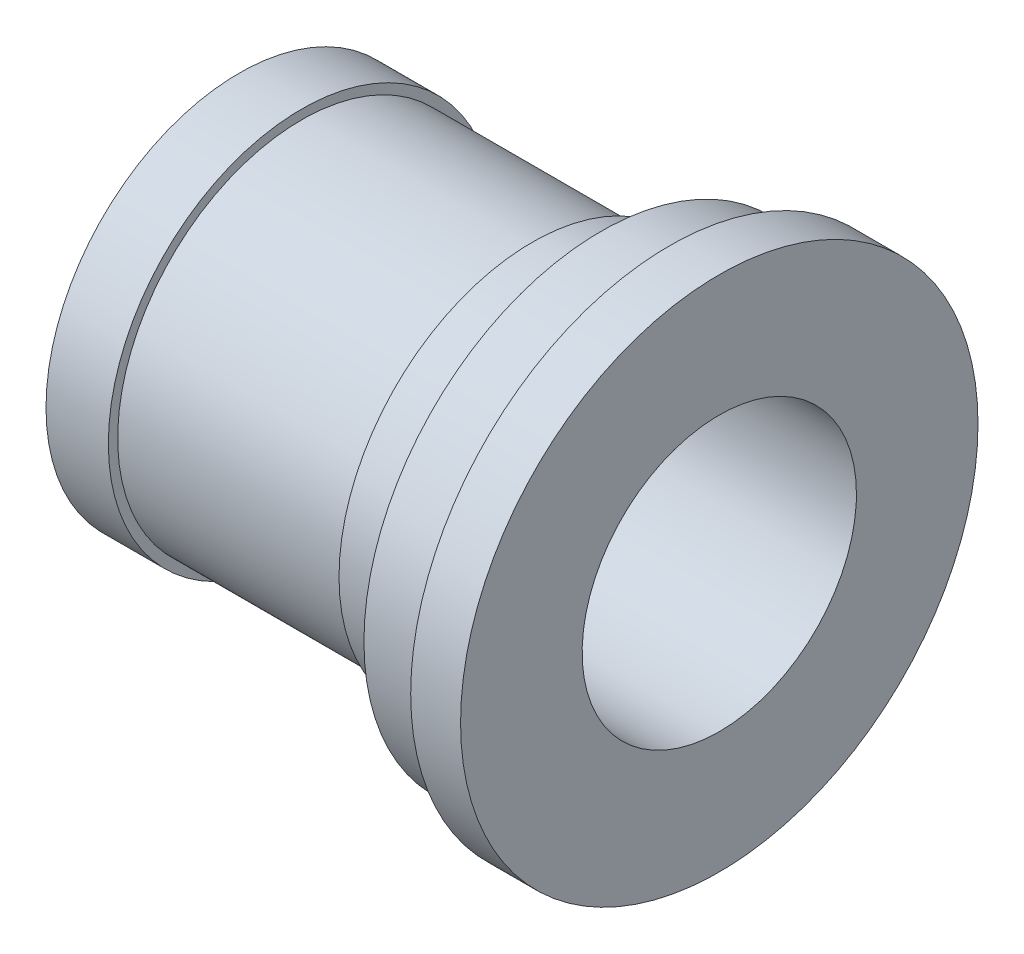
ISO-10303-21;
HEADER;
FILE_DESCRIPTION(('STEP AP214'),'2;1');
FILE_NAME('part.step','',(''),(''),'','','');
FILE_SCHEMA(('AUTOMOTIVE_DESIGN { 1 0 10303 214 1 1 1 1 }'));
ENDSEC;
DATA;
#1=APPLICATION_CONTEXT('core data for automotive mechanical design processes');
#2=APPLICATION_PROTOCOL_DEFINITION('international standard','automotive_design',2000,#1);
#3=PRODUCT_CONTEXT('',#1,'mechanical');
#4=PRODUCT('Part','Part','',(#3));
#5=PRODUCT_RELATED_PRODUCT_CATEGORY('part','',(#4));
#6=PRODUCT_DEFINITION_FORMATION('','',#4);
#7=PRODUCT_DEFINITION_CONTEXT('part definition',#1,'design');
#8=PRODUCT_DEFINITION('design','',#6,#7);
#9=PRODUCT_DEFINITION_SHAPE('','',#8);
#10=(LENGTH_UNIT() NAMED_UNIT(*) SI_UNIT(.MILLI.,.METRE.));
#11=(NAMED_UNIT(*) PLANE_ANGLE_UNIT() SI_UNIT($,.RADIAN.));
#12=(NAMED_UNIT(*) SI_UNIT($,.STERADIAN.) SOLID_ANGLE_UNIT());
#13=UNCERTAINTY_MEASURE_WITH_UNIT(LENGTH_MEASURE(1.E-05),#10,'distance_accuracy_value','');
#14=(GEOMETRIC_REPRESENTATION_CONTEXT(3) GLOBAL_UNCERTAINTY_ASSIGNED_CONTEXT((#13)) GLOBAL_UNIT_ASSIGNED_CONTEXT((#10,
#11,#12)) REPRESENTATION_CONTEXT('',''));
#15=CARTESIAN_POINT('',(0.,0.,0.));
#16=DIRECTION('',(0.,0.,1.));
#17=DIRECTION('',(1.,0.,0.));
#18=AXIS2_PLACEMENT_3D('',#15,#16,#17);
#19=CARTESIAN_POINT('',(10.,0.,0.));
#20=DIRECTION('',(1.,0.,0.));
#21=DIRECTION('',(0.,0.,-1.));
#22=AXIS2_PLACEMENT_3D('',#19,#20,#21);
#23=PLANE('',#22);
#24=CARTESIAN_POINT('',(10.,0.,0.));
#25=DIRECTION('',(1.,0.,0.));
#26=DIRECTION('',(0.,0.,-1.));
#27=AXIS2_PLACEMENT_3D('',#24,#25,#26);
#28=CIRCLE('',#27,31.);
#29=CARTESIAN_POINT('',(10.,0.,-31.));
#30=VERTEX_POINT('',#29);
#31=EDGE_CURVE('E75',#30,#30,#28,.T.);
#32=ORIENTED_EDGE('',*,*,#31,.T.);
#33=EDGE_LOOP('',(#32));
#34=FACE_BOUND('',#33,.T.);
#35=CARTESIAN_POINT('',(10.,0.,0.));
#36=DIRECTION('',(1.,0.,0.));
#37=DIRECTION('',(0.,0.,-1.));
#38=AXIS2_PLACEMENT_3D('',#35,#36,#37);
#39=CIRCLE('',#38,29.5);
#40=CARTESIAN_POINT('',(10.,0.,-29.5));
#41=VERTEX_POINT('',#40);
#42=EDGE_CURVE('E78',#41,#41,#39,.T.);
#43=ORIENTED_EDGE('',*,*,#42,.F.);
#44=EDGE_LOOP('',(#43));
#45=FACE_BOUND('',#44,.T.);
#46=ADVANCED_FACE('F33',(#34,#45),#23,.T.);
#47=CARTESIAN_POINT('',(0.,0.,0.));
#48=DIRECTION('',(1.,0.,0.));
#49=DIRECTION('',(0.,0.,-1.));
#50=AXIS2_PLACEMENT_3D('',#47,#48,#49);
#51=PLANE('',#50);
#52=CARTESIAN_POINT('',(0.,0.,0.));
#53=DIRECTION('',(1.,0.,0.));
#54=DIRECTION('',(0.,0.,-1.));
#55=AXIS2_PLACEMENT_3D('',#52,#53,#54);
#56=CIRCLE('',#55,31.);
#57=CARTESIAN_POINT('',(0.,0.,-31.));
#58=VERTEX_POINT('',#57);
#59=EDGE_CURVE('E71',#58,#58,#56,.T.);
#60=ORIENTED_EDGE('',*,*,#59,.F.);
#61=EDGE_LOOP('',(#60));
#62=FACE_BOUND('',#61,.T.);
#63=CARTESIAN_POINT('',(0.,0.,0.));
#64=DIRECTION('',(1.,0.,0.));
#65=DIRECTION('',(0.,0.,-1.));
#66=AXIS2_PLACEMENT_3D('',#63,#64,#65);
#67=CIRCLE('',#66,22.);
#68=CARTESIAN_POINT('',(0.,1.49912810403716,-21.9488636363636));
#69=VERTEX_POINT('',#68);
#70=CARTESIAN_POINT('',(0.,-1.49912810403716,-21.9488636363636));
#71=VERTEX_POINT('',#70);
#72=EDGE_CURVE('E67',#69,#71,#67,.T.);
#73=ORIENTED_EDGE('',*,*,#72,.T.);
#74=CARTESIAN_POINT('',(0.,0.,-22.));
#75=DIRECTION('',(-1.,0.,0.));
#76=DIRECTION('',(0.,0.,1.));
#77=AXIS2_PLACEMENT_3D('',#74,#75,#76);
#78=CIRCLE('',#77,1.5);
#79=EDGE_CURVE('E60',#69,#71,#78,.T.);
#80=ORIENTED_EDGE('',*,*,#79,.F.);
#81=EDGE_LOOP('',(#73,#80));
#82=FACE_BOUND('',#81,.T.);
#83=ADVANCED_FACE('F66',(#62,#82),#51,.F.);
#84=CARTESIAN_POINT('',(10.,0.,0.));
#85=DIRECTION('',(-1.,0.,0.));
#86=DIRECTION('',(0.,0.,1.));
#87=AXIS2_PLACEMENT_3D('',#84,#85,#86);
#88=CYLINDRICAL_SURFACE('',#87,31.);
#89=ORIENTED_EDGE('',*,*,#31,.F.);
#90=EDGE_LOOP('',(#89));
#91=FACE_BOUND('',#90,.T.);
#92=ORIENTED_EDGE('',*,*,#59,.T.);
#93=EDGE_LOOP('',(#92));
#94=FACE_BOUND('',#93,.T.);
#95=ADVANCED_FACE('F35',(#91,#94),#88,.T.);
#96=CARTESIAN_POINT('',(10.,0.,0.));
#97=DIRECTION('',(-1.,0.,0.));
#98=DIRECTION('',(0.,0.,1.));
#99=AXIS2_PLACEMENT_3D('',#96,#97,#98);
#100=CYLINDRICAL_SURFACE('',#99,22.);
#101=DIRECTION('',(-1.,0.,0.));
#102=VECTOR('',#101,1.);
#103=CARTESIAN_POINT('',(2.5,-1.49912810403716,-21.9488636363636));
#104=LINE('',#103,#102);
#105=CARTESIAN_POINT('',(5.,-1.49912810403716,-21.9488636363636));
#106=VERTEX_POINT('',#105);
#107=EDGE_CURVE('E11',#71,#106,#104,.F.);
#108=ORIENTED_EDGE('',*,*,#107,.F.);
#109=ORIENTED_EDGE('',*,*,#72,.F.);
#110=DIRECTION('',(-1.,0.,0.));
#111=VECTOR('',#110,1.);
#112=CARTESIAN_POINT('',(2.5,1.49912810403716,-21.9488636363636));
#113=LINE('',#112,#111);
#114=CARTESIAN_POINT('',(5.,1.49912810403716,-21.9488636363636));
#115=VERTEX_POINT('',#114);
#116=EDGE_CURVE('E41',#115,#69,#113,.T.);
#117=ORIENTED_EDGE('',*,*,#116,.F.);
#118=CARTESIAN_POINT('',(5.,0.,0.));
#119=DIRECTION('',(-1.,0.,0.));
#120=DIRECTION('',(0.,0.,1.));
#121=AXIS2_PLACEMENT_3D('',#118,#119,#120);
#122=CIRCLE('',#121,22.);
#123=EDGE_CURVE('E50',#115,#106,#122,.T.);
#124=ORIENTED_EDGE('',*,*,#123,.T.);
#125=EDGE_LOOP('',(#108,#109,#117,#124));
#126=FACE_BOUND('',#125,.T.);
#127=CARTESIAN_POINT('',(77.,0.,0.));
#128=DIRECTION('',(1.,0.,0.));
#129=DIRECTION('',(0.,0.,-1.));
#130=AXIS2_PLACEMENT_3D('',#127,#128,#129);
#131=CIRCLE('',#130,22.);
#132=CARTESIAN_POINT('',(77.,0.,-22.));
#133=VERTEX_POINT('',#132);
#134=EDGE_CURVE('E236',#133,#133,#131,.T.);
#135=ORIENTED_EDGE('',*,*,#134,.T.);
#136=EDGE_LOOP('',(#135));
#137=FACE_BOUND('',#136,.T.);
#138=ADVANCED_FACE('F69',(#126,#137),#100,.F.);
#139=CARTESIAN_POINT('',(47.,0.,0.));
#140=DIRECTION('',(-1.,0.,0.));
#141=DIRECTION('',(0.,0.,1.));
#142=AXIS2_PLACEMENT_3D('',#139,#140,#141);
#143=CYLINDRICAL_SURFACE('',#142,29.5);
#144=CARTESIAN_POINT('',(47.,0.,0.));
#145=DIRECTION('',(1.,0.,0.));
#146=DIRECTION('',(0.,0.,-1.));
#147=AXIS2_PLACEMENT_3D('',#144,#145,#146);
#148=CIRCLE('',#147,29.5);
#149=CARTESIAN_POINT('',(47.,0.,-29.5));
#150=VERTEX_POINT('',#149);
#151=EDGE_CURVE('E72',#150,#150,#148,.T.);
#152=ORIENTED_EDGE('',*,*,#151,.F.);
#153=EDGE_LOOP('',(#152));
#154=FACE_BOUND('',#153,.T.);
#155=ORIENTED_EDGE('',*,*,#42,.T.);
#156=EDGE_LOOP('',(#155));
#157=FACE_BOUND('',#156,.T.);
#158=ADVANCED_FACE('F100',(#154,#157),#143,.T.);
#159=CARTESIAN_POINT('',(47.,0.,0.));
#160=DIRECTION('',(1.,0.,0.));
#161=DIRECTION('',(0.,0.,-1.));
#162=AXIS2_PLACEMENT_3D('',#159,#160,#161);
#163=PLANE('',#162);
#164=ORIENTED_EDGE('',*,*,#151,.T.);
#165=EDGE_LOOP('',(#164));
#166=FACE_BOUND('',#165,.T.);
#167=CARTESIAN_POINT('',(47.,0.,0.));
#168=DIRECTION('',(1.,0.,0.));
#169=DIRECTION('',(0.,0.,-1.));
#170=AXIS2_PLACEMENT_3D('',#167,#168,#169);
#171=CIRCLE('',#170,31.);
#172=CARTESIAN_POINT('',(47.,0.,-31.));
#173=VERTEX_POINT('',#172);
#174=EDGE_CURVE('E248',#173,#173,#171,.T.);
#175=ORIENTED_EDGE('',*,*,#174,.F.);
#176=EDGE_LOOP('',(#175));
#177=FACE_BOUND('',#176,.T.);
#178=ADVANCED_FACE('F103',(#166,#177),#163,.F.);
#179=CARTESIAN_POINT('',(58.,0.,0.));
#180=DIRECTION('',(-1.,0.,0.));
#181=DIRECTION('',(0.,0.,1.));
#182=AXIS2_PLACEMENT_3D('',#179,#180,#181);
#183=CYLINDRICAL_SURFACE('',#182,31.);
#184=CARTESIAN_POINT('',(58.,0.,0.));
#185=DIRECTION('',(1.,0.,0.));
#186=DIRECTION('',(0.,0.,-1.));
#187=AXIS2_PLACEMENT_3D('',#184,#185,#186);
#188=CIRCLE('',#187,31.);
#189=CARTESIAN_POINT('',(58.,0.,-31.));
#190=VERTEX_POINT('',#189);
#191=EDGE_CURVE('E251',#190,#190,#188,.T.);
#192=ORIENTED_EDGE('',*,*,#191,.F.);
#193=EDGE_LOOP('',(#192));
#194=FACE_BOUND('',#193,.T.);
#195=ORIENTED_EDGE('',*,*,#174,.T.);
#196=EDGE_LOOP('',(#195));
#197=FACE_BOUND('',#196,.T.);
#198=ADVANCED_FACE('F105',(#194,#197),#183,.T.);
#199=CARTESIAN_POINT('',(58.,0.,0.));
#200=DIRECTION('',(1.,0.,0.));
#201=DIRECTION('',(0.,0.,-1.));
#202=AXIS2_PLACEMENT_3D('',#199,#200,#201);
#203=PLANE('',#202);
#204=ORIENTED_EDGE('',*,*,#191,.T.);
#205=EDGE_LOOP('',(#204));
#206=FACE_BOUND('',#205,.T.);
#207=CARTESIAN_POINT('',(58.,0.,0.));
#208=DIRECTION('',(1.,0.,0.));
#209=DIRECTION('',(0.,0.,-1.));
#210=AXIS2_PLACEMENT_3D('',#207,#208,#209);
#211=CIRCLE('',#210,38.);
#212=CARTESIAN_POINT('',(58.,0.,-38.));
#213=VERTEX_POINT('',#212);
#214=EDGE_CURVE('E243',#213,#213,#211,.T.);
#215=ORIENTED_EDGE('',*,*,#214,.F.);
#216=EDGE_LOOP('',(#215));
#217=FACE_BOUND('',#216,.T.);
#218=ADVANCED_FACE('F108',(#206,#217),#203,.F.);
#219=CARTESIAN_POINT('',(69.,0.,0.));
#220=DIRECTION('',(-1.,0.,0.));
#221=DIRECTION('',(0.,0.,1.));
#222=AXIS2_PLACEMENT_3D('',#219,#220,#221);
#223=CYLINDRICAL_SURFACE('',#222,38.);
#224=CARTESIAN_POINT('',(69.,0.,0.));
#225=DIRECTION('',(1.,0.,0.));
#226=DIRECTION('',(0.,0.,-1.));
#227=AXIS2_PLACEMENT_3D('',#224,#225,#226);
#228=CIRCLE('',#227,38.);
#229=CARTESIAN_POINT('',(69.,0.,-38.));
#230=VERTEX_POINT('',#229);
#231=EDGE_CURVE('E245',#230,#230,#228,.T.);
#232=ORIENTED_EDGE('',*,*,#231,.F.);
#233=EDGE_LOOP('',(#232));
#234=FACE_BOUND('',#233,.T.);
#235=ORIENTED_EDGE('',*,*,#214,.T.);
#236=EDGE_LOOP('',(#235));
#237=FACE_BOUND('',#236,.T.);
#238=ADVANCED_FACE('F113',(#234,#237),#223,.T.);
#239=CARTESIAN_POINT('',(77.,0.,0.));
#240=DIRECTION('',(1.,0.,0.));
#241=DIRECTION('',(0.,0.,-1.));
#242=AXIS2_PLACEMENT_3D('',#239,#240,#241);
#243=PLANE('',#242);
#244=CARTESIAN_POINT('',(77.,0.,0.));
#245=DIRECTION('',(1.,0.,0.));
#246=DIRECTION('',(0.,0.,-1.));
#247=AXIS2_PLACEMENT_3D('',#244,#245,#246);
#248=CIRCLE('',#247,41.5);
#249=CARTESIAN_POINT('',(77.,0.,-41.5));
#250=VERTEX_POINT('',#249);
#251=EDGE_CURVE('E233',#250,#250,#248,.T.);
#252=ORIENTED_EDGE('',*,*,#251,.T.);
#253=EDGE_LOOP('',(#252));
#254=FACE_BOUND('',#253,.T.);
#255=ORIENTED_EDGE('',*,*,#134,.F.);
#256=EDGE_LOOP('',(#255));
#257=FACE_BOUND('',#256,.T.);
#258=ADVANCED_FACE('F116',(#254,#257),#243,.T.);
#259=CARTESIAN_POINT('',(69.,0.,0.));
#260=DIRECTION('',(1.,0.,0.));
#261=DIRECTION('',(0.,0.,-1.));
#262=AXIS2_PLACEMENT_3D('',#259,#260,#261);
#263=PLANE('',#262);
#264=ORIENTED_EDGE('',*,*,#231,.T.);
#265=EDGE_LOOP('',(#264));
#266=FACE_BOUND('',#265,.T.);
#267=CARTESIAN_POINT('',(69.,0.,0.));
#268=DIRECTION('',(1.,0.,0.));
#269=DIRECTION('',(0.,0.,-1.));
#270=AXIS2_PLACEMENT_3D('',#267,#268,#269);
#271=CIRCLE('',#270,41.5);
#272=CARTESIAN_POINT('',(69.,0.,-41.5));
#273=VERTEX_POINT('',#272);
#274=EDGE_CURVE('E237',#273,#273,#271,.T.);
#275=ORIENTED_EDGE('',*,*,#274,.F.);
#276=EDGE_LOOP('',(#275));
#277=FACE_BOUND('',#276,.T.);
#278=ADVANCED_FACE('F124',(#266,#277),#263,.F.);
#279=CARTESIAN_POINT('',(77.,0.,0.));
#280=DIRECTION('',(-1.,0.,0.));
#281=DIRECTION('',(0.,0.,1.));
#282=AXIS2_PLACEMENT_3D('',#279,#280,#281);
#283=CYLINDRICAL_SURFACE('',#282,41.5);
#284=ORIENTED_EDGE('',*,*,#251,.F.);
#285=EDGE_LOOP('',(#284));
#286=FACE_BOUND('',#285,.T.);
#287=ORIENTED_EDGE('',*,*,#274,.T.);
#288=EDGE_LOOP('',(#287));
#289=FACE_BOUND('',#288,.T.);
#290=ADVANCED_FACE('F121',(#286,#289),#283,.T.);
#291=CARTESIAN_POINT('',(5.,0.,-22.));
#292=DIRECTION('',(-1.,0.,0.));
#293=DIRECTION('',(0.,0.,1.));
#294=AXIS2_PLACEMENT_3D('',#291,#292,#293);
#295=CYLINDRICAL_SURFACE('',#294,1.5);
#296=ORIENTED_EDGE('',*,*,#107,.T.);
#297=CARTESIAN_POINT('',(5.,0.,-22.));
#298=DIRECTION('',(-1.,0.,0.));
#299=DIRECTION('',(0.,0.,1.));
#300=AXIS2_PLACEMENT_3D('',#297,#298,#299);
#301=CIRCLE('',#300,1.5);
#302=EDGE_CURVE('E47',#115,#106,#301,.T.);
#303=ORIENTED_EDGE('',*,*,#302,.F.);
#304=ORIENTED_EDGE('',*,*,#116,.T.);
#305=ORIENTED_EDGE('',*,*,#79,.T.);
#306=EDGE_LOOP('',(#296,#303,#304,#305));
#307=FACE_BOUND('',#306,.T.);
#308=ADVANCED_FACE('F59',(#307),#295,.F.);
#309=CARTESIAN_POINT('',(5.,0.,-22.));
#310=DIRECTION('',(-1.,0.,0.));
#311=DIRECTION('',(0.,0.,1.));
#312=AXIS2_PLACEMENT_3D('',#309,#310,#311);
#313=PLANE('',#312);
#314=ORIENTED_EDGE('',*,*,#302,.T.);
#315=ORIENTED_EDGE('',*,*,#123,.F.);
#316=EDGE_LOOP('',(#314,#315));
#317=FACE_BOUND('',#316,.T.);
#318=ADVANCED_FACE('F134',(#317),#313,.T.);
#319=CLOSED_SHELL('',(#46,#83,#95,#138,#158,#178,#198,#218,#238,#258,#278,#290,#308,#318));
#320=MANIFOLD_SOLID_BREP('B2',#319);
#321=ADVANCED_BREP_SHAPE_REPRESENTATION('',(#18,#320),#14);
#322=SHAPE_DEFINITION_REPRESENTATION(#9,#321);
ENDSEC;
END-ISO-10303-21;
